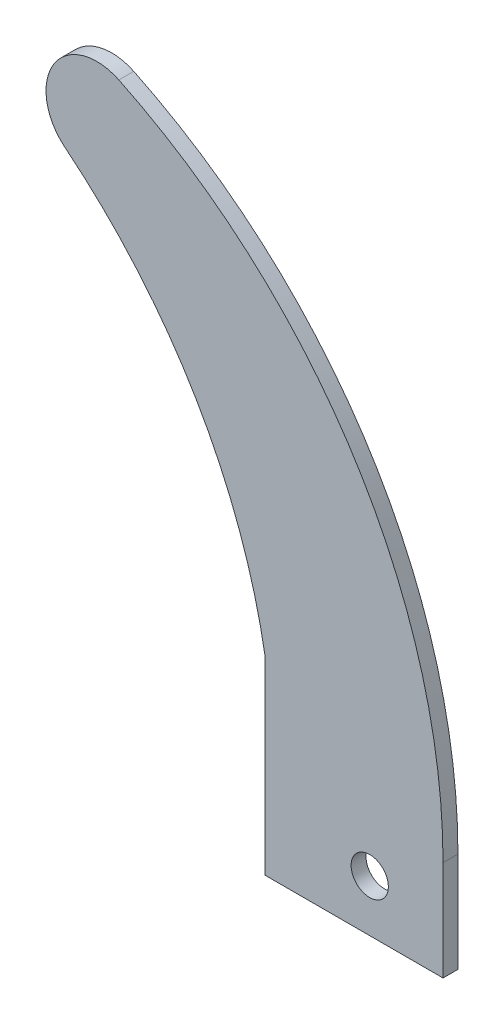
ISO-10303-21;
HEADER;
FILE_DESCRIPTION(('STEP AP214'),'2;1');
FILE_NAME('part.step','',(''),(''),'','','');
FILE_SCHEMA(('AUTOMOTIVE_DESIGN { 1 0 10303 214 1 1 1 1 }'));
ENDSEC;
DATA;
#1=APPLICATION_CONTEXT('core data for automotive mechanical design processes');
#2=APPLICATION_PROTOCOL_DEFINITION('international standard','automotive_design',2000,#1);
#3=PRODUCT_CONTEXT('',#1,'mechanical');
#4=PRODUCT('Part','Part','',(#3));
#5=PRODUCT_RELATED_PRODUCT_CATEGORY('part','',(#4));
#6=PRODUCT_DEFINITION_FORMATION('','',#4);
#7=PRODUCT_DEFINITION_CONTEXT('part definition',#1,'design');
#8=PRODUCT_DEFINITION('design','',#6,#7);
#9=PRODUCT_DEFINITION_SHAPE('','',#8);
#10=(LENGTH_UNIT() NAMED_UNIT(*) SI_UNIT(.MILLI.,.METRE.));
#11=(NAMED_UNIT(*) PLANE_ANGLE_UNIT() SI_UNIT($,.RADIAN.));
#12=(NAMED_UNIT(*) SI_UNIT($,.STERADIAN.) SOLID_ANGLE_UNIT());
#13=UNCERTAINTY_MEASURE_WITH_UNIT(LENGTH_MEASURE(1.E-05),#10,'distance_accuracy_value','');
#14=(GEOMETRIC_REPRESENTATION_CONTEXT(3) GLOBAL_UNCERTAINTY_ASSIGNED_CONTEXT((#13)) GLOBAL_UNIT_ASSIGNED_CONTEXT((#10,
#11,#12)) REPRESENTATION_CONTEXT('',''));
#15=CARTESIAN_POINT('',(0.,0.,0.));
#16=DIRECTION('',(0.,0.,1.));
#17=DIRECTION('',(1.,0.,0.));
#18=AXIS2_PLACEMENT_3D('',#15,#16,#17);
#19=CARTESIAN_POINT('',(-66.961118674711,6.46838453203618,2.));
#20=DIRECTION('',(0.,0.,1.));
#21=DIRECTION('',(1.,0.,0.));
#22=AXIS2_PLACEMENT_3D('',#19,#20,#21);
#23=PLANE('',#22);
#24=DIRECTION('',(0.,-1.,0.));
#25=VECTOR('',#24,1.);
#26=CARTESIAN_POINT('',(-14.0336686671728,18.503208773355,2.));
#27=LINE('',#26,#25);
#28=CARTESIAN_POINT('',(-14.0336686671728,18.503208773355,2.));
#29=VERTEX_POINT('',#28);
#30=CARTESIAN_POINT('',(-14.0336686671728,-6.92774167343622,2.));
#31=VERTEX_POINT('',#30);
#32=EDGE_CURVE('E129',#29,#31,#27,.T.);
#33=ORIENTED_EDGE('',*,*,#32,.T.);
#34=DIRECTION('',(1.,0.,0.));
#35=VECTOR('',#34,1.);
#36=CARTESIAN_POINT('',(-14.0336686671728,-6.92774167343622,2.));
#37=LINE('',#36,#35);
#38=CARTESIAN_POINT('',(9.83621253507358,-6.92774167343622,2.));
#39=VERTEX_POINT('',#38);
#40=EDGE_CURVE('E87',#31,#39,#37,.T.);
#41=ORIENTED_EDGE('',*,*,#40,.T.);
#42=DIRECTION('',(0.,1.,0.));
#43=VECTOR('',#42,1.);
#44=CARTESIAN_POINT('',(9.83621253507358,-6.92774167343622,2.));
#45=LINE('',#44,#43);
#46=CARTESIAN_POINT('',(9.83621253507358,6.46838453203618,2.));
#47=VERTEX_POINT('',#46);
#48=EDGE_CURVE('E100',#39,#47,#45,.T.);
#49=ORIENTED_EDGE('',*,*,#48,.T.);
#50=CARTESIAN_POINT('',(-66.961118674711,6.46838453203618,2.));
#51=DIRECTION('',(0.,0.,1.));
#52=DIRECTION('',(1.,0.,0.));
#53=AXIS2_PLACEMENT_3D('',#50,#51,#52);
#54=CIRCLE('',#53,76.7973312097845);
#55=CARTESIAN_POINT('',(-33.6561799216915,75.6681759739399,2.));
#56=VERTEX_POINT('',#55);
#57=EDGE_CURVE('E94',#47,#56,#54,.T.);
#58=ORIENTED_EDGE('',*,*,#57,.T.);
#59=CARTESIAN_POINT('',(-36.6124184298216,69.5258110312479,2.));
#60=DIRECTION('',(0.,0.,1.));
#61=DIRECTION('',(1.,0.,0.));
#62=AXIS2_PLACEMENT_3D('',#59,#60,#61);
#63=CIRCLE('',#62,6.81674359252003);
#64=CARTESIAN_POINT('',(-40.898194287924,64.2248565416989,2.));
#65=VERTEX_POINT('',#64);
#66=EDGE_CURVE('E98',#56,#65,#63,.T.);
#67=ORIENTED_EDGE('',*,*,#66,.T.);
#68=CARTESIAN_POINT('',(-88.261434941398,5.64260877739589,2.));
#69=DIRECTION('',(0.,0.,-1.));
#70=DIRECTION('',(-1.,0.,0.));
#71=AXIS2_PLACEMENT_3D('',#68,#69,#70);
#72=CIRCLE('',#71,75.333633380563);
#73=EDGE_CURVE('E50',#65,#29,#72,.T.);
#74=ORIENTED_EDGE('',*,*,#73,.T.);
#75=EDGE_LOOP('',(#33,#41,#49,#58,#67,#74));
#76=FACE_BOUND('',#75,.T.);
#77=CARTESIAN_POINT('',(0.,0.,2.));
#78=DIRECTION('',(0.,0.,1.));
#79=DIRECTION('',(1.,0.,0.));
#80=AXIS2_PLACEMENT_3D('',#77,#78,#79);
#81=CIRCLE('',#80,2.5);
#82=CARTESIAN_POINT('',(2.5,0.,2.));
#83=VERTEX_POINT('',#82);
#84=EDGE_CURVE('E122',#83,#83,#81,.T.);
#85=ORIENTED_EDGE('',*,*,#84,.F.);
#86=EDGE_LOOP('',(#85));
#87=FACE_BOUND('',#86,.T.);
#88=ADVANCED_FACE('F33',(#76,#87),#23,.T.);
#89=CARTESIAN_POINT('',(-66.961118674711,6.46838453203618,0.));
#90=DIRECTION('',(0.,0.,1.));
#91=DIRECTION('',(1.,0.,0.));
#92=AXIS2_PLACEMENT_3D('',#89,#90,#91);
#93=PLANE('',#92);
#94=DIRECTION('',(0.,-1.,0.));
#95=VECTOR('',#94,1.);
#96=CARTESIAN_POINT('',(-14.0336686671728,18.503208773355,0.));
#97=LINE('',#96,#95);
#98=CARTESIAN_POINT('',(-14.0336686671728,18.503208773355,0.));
#99=VERTEX_POINT('',#98);
#100=CARTESIAN_POINT('',(-14.0336686671728,-6.92774167343622,0.));
#101=VERTEX_POINT('',#100);
#102=EDGE_CURVE('E118',#99,#101,#97,.T.);
#103=ORIENTED_EDGE('',*,*,#102,.F.);
#104=CARTESIAN_POINT('',(-88.261434941398,5.64260877739589,0.));
#105=DIRECTION('',(0.,0.,-1.));
#106=DIRECTION('',(-1.,0.,0.));
#107=AXIS2_PLACEMENT_3D('',#104,#105,#106);
#108=CIRCLE('',#107,75.333633380563);
#109=CARTESIAN_POINT('',(-40.898194287924,64.2248565416989,0.));
#110=VERTEX_POINT('',#109);
#111=EDGE_CURVE('E79',#110,#99,#108,.T.);
#112=ORIENTED_EDGE('',*,*,#111,.F.);
#113=CARTESIAN_POINT('',(-36.6124184298216,69.5258110312479,0.));
#114=DIRECTION('',(0.,0.,1.));
#115=DIRECTION('',(1.,0.,0.));
#116=AXIS2_PLACEMENT_3D('',#113,#114,#115);
#117=CIRCLE('',#116,6.81674359252003);
#118=CARTESIAN_POINT('',(-33.6561799216915,75.6681759739399,0.));
#119=VERTEX_POINT('',#118);
#120=EDGE_CURVE('E73',#119,#110,#117,.T.);
#121=ORIENTED_EDGE('',*,*,#120,.F.);
#122=CARTESIAN_POINT('',(-66.961118674711,6.46838453203618,0.));
#123=DIRECTION('',(0.,0.,1.));
#124=DIRECTION('',(1.,0.,0.));
#125=AXIS2_PLACEMENT_3D('',#122,#123,#124);
#126=CIRCLE('',#125,76.7973312097845);
#127=CARTESIAN_POINT('',(9.83621253507358,6.46838453203618,0.));
#128=VERTEX_POINT('',#127);
#129=EDGE_CURVE('E108',#128,#119,#126,.T.);
#130=ORIENTED_EDGE('',*,*,#129,.F.);
#131=DIRECTION('',(0.,1.,0.));
#132=VECTOR('',#131,1.);
#133=CARTESIAN_POINT('',(9.83621253507358,-6.92774167343622,0.));
#134=LINE('',#133,#132);
#135=CARTESIAN_POINT('',(9.83621253507358,-6.92774167343622,0.));
#136=VERTEX_POINT('',#135);
#137=EDGE_CURVE('E124',#136,#128,#134,.T.);
#138=ORIENTED_EDGE('',*,*,#137,.F.);
#139=DIRECTION('',(1.,0.,0.));
#140=VECTOR('',#139,1.);
#141=CARTESIAN_POINT('',(-14.0336686671728,-6.92774167343622,0.));
#142=LINE('',#141,#140);
#143=EDGE_CURVE('E121',#101,#136,#142,.T.);
#144=ORIENTED_EDGE('',*,*,#143,.F.);
#145=EDGE_LOOP('',(#103,#112,#121,#130,#138,#144));
#146=FACE_BOUND('',#145,.T.);
#147=CARTESIAN_POINT('',(0.,0.,0.));
#148=DIRECTION('',(0.,0.,1.));
#149=DIRECTION('',(1.,0.,0.));
#150=AXIS2_PLACEMENT_3D('',#147,#148,#149);
#151=CIRCLE('',#150,2.5);
#152=CARTESIAN_POINT('',(2.5,0.,0.));
#153=VERTEX_POINT('',#152);
#154=EDGE_CURVE('E222',#153,#153,#151,.T.);
#155=ORIENTED_EDGE('',*,*,#154,.T.);
#156=EDGE_LOOP('',(#155));
#157=FACE_BOUND('',#156,.T.);
#158=ADVANCED_FACE('F138',(#146,#157),#93,.F.);
#159=CARTESIAN_POINT('',(-14.0336686671728,18.503208773355,2.));
#160=DIRECTION('',(1.,0.,0.));
#161=DIRECTION('',(0.,0.,-1.));
#162=AXIS2_PLACEMENT_3D('',#159,#160,#161);
#163=PLANE('',#162);
#164=ORIENTED_EDGE('',*,*,#102,.T.);
#165=DIRECTION('',(0.,0.,-1.));
#166=VECTOR('',#165,1.);
#167=CARTESIAN_POINT('',(-14.0336686671728,-6.92774167343622,2.));
#168=LINE('',#167,#166);
#169=EDGE_CURVE('E11',#31,#101,#168,.T.);
#170=ORIENTED_EDGE('',*,*,#169,.F.);
#171=ORIENTED_EDGE('',*,*,#32,.F.);
#172=DIRECTION('',(0.,0.,-1.));
#173=VECTOR('',#172,1.);
#174=CARTESIAN_POINT('',(-14.0336686671728,18.503208773355,2.));
#175=LINE('',#174,#173);
#176=EDGE_CURVE('E114',#29,#99,#175,.T.);
#177=ORIENTED_EDGE('',*,*,#176,.T.);
#178=EDGE_LOOP('',(#164,#170,#171,#177));
#179=FACE_BOUND('',#178,.T.);
#180=ADVANCED_FACE('F35',(#179),#163,.F.);
#181=CARTESIAN_POINT('',(-14.0336686671728,-6.92774167343622,2.));
#182=DIRECTION('',(0.,1.,0.));
#183=DIRECTION('',(0.,0.,1.));
#184=AXIS2_PLACEMENT_3D('',#181,#182,#183);
#185=PLANE('',#184);
#186=ORIENTED_EDGE('',*,*,#143,.T.);
#187=DIRECTION('',(0.,0.,-1.));
#188=VECTOR('',#187,1.);
#189=CARTESIAN_POINT('',(9.83621253507358,-6.92774167343622,2.));
#190=LINE('',#189,#188);
#191=EDGE_CURVE('E42',#39,#136,#190,.T.);
#192=ORIENTED_EDGE('',*,*,#191,.F.);
#193=ORIENTED_EDGE('',*,*,#40,.F.);
#194=ORIENTED_EDGE('',*,*,#169,.T.);
#195=EDGE_LOOP('',(#186,#192,#193,#194));
#196=FACE_BOUND('',#195,.T.);
#197=ADVANCED_FACE('F163',(#196),#185,.F.);
#198=CARTESIAN_POINT('',(9.83621253507358,-6.92774167343622,2.));
#199=DIRECTION('',(-1.,0.,0.));
#200=DIRECTION('',(0.,0.,1.));
#201=AXIS2_PLACEMENT_3D('',#198,#199,#200);
#202=PLANE('',#201);
#203=ORIENTED_EDGE('',*,*,#137,.T.);
#204=DIRECTION('',(0.,0.,-1.));
#205=VECTOR('',#204,1.);
#206=CARTESIAN_POINT('',(9.83621253507358,6.46838453203618,2.));
#207=LINE('',#206,#205);
#208=EDGE_CURVE('E109',#47,#128,#207,.T.);
#209=ORIENTED_EDGE('',*,*,#208,.F.);
#210=ORIENTED_EDGE('',*,*,#48,.F.);
#211=ORIENTED_EDGE('',*,*,#191,.T.);
#212=EDGE_LOOP('',(#203,#209,#210,#211));
#213=FACE_BOUND('',#212,.T.);
#214=ADVANCED_FACE('F135',(#213),#202,.F.);
#215=CARTESIAN_POINT('',(-66.961118674711,6.46838453203618,2.));
#216=DIRECTION('',(0.,0.,-1.));
#217=DIRECTION('',(-1.,0.,0.));
#218=AXIS2_PLACEMENT_3D('',#215,#216,#217);
#219=CYLINDRICAL_SURFACE('',#218,76.7973312097845);
#220=ORIENTED_EDGE('',*,*,#129,.T.);
#221=DIRECTION('',(0.,0.,-1.));
#222=VECTOR('',#221,1.);
#223=CARTESIAN_POINT('',(-33.6561799216915,75.6681759739399,2.));
#224=LINE('',#223,#222);
#225=EDGE_CURVE('E105',#56,#119,#224,.T.);
#226=ORIENTED_EDGE('',*,*,#225,.F.);
#227=ORIENTED_EDGE('',*,*,#57,.F.);
#228=ORIENTED_EDGE('',*,*,#208,.T.);
#229=EDGE_LOOP('',(#220,#226,#227,#228));
#230=FACE_BOUND('',#229,.T.);
#231=ADVANCED_FACE('F106',(#230),#219,.T.);
#232=CARTESIAN_POINT('',(-36.6124184298216,69.5258110312479,2.));
#233=DIRECTION('',(0.,0.,-1.));
#234=DIRECTION('',(-1.,0.,0.));
#235=AXIS2_PLACEMENT_3D('',#232,#233,#234);
#236=CYLINDRICAL_SURFACE('',#235,6.81674359252003);
#237=ORIENTED_EDGE('',*,*,#120,.T.);
#238=DIRECTION('',(0.,0.,-1.));
#239=VECTOR('',#238,1.);
#240=CARTESIAN_POINT('',(-40.898194287924,64.2248565416989,2.));
#241=LINE('',#240,#239);
#242=EDGE_CURVE('E110',#65,#110,#241,.T.);
#243=ORIENTED_EDGE('',*,*,#242,.F.);
#244=ORIENTED_EDGE('',*,*,#66,.F.);
#245=ORIENTED_EDGE('',*,*,#225,.T.);
#246=EDGE_LOOP('',(#237,#243,#244,#245));
#247=FACE_BOUND('',#246,.T.);
#248=ADVANCED_FACE('F112',(#247),#236,.T.);
#249=CARTESIAN_POINT('',(-88.261434941398,5.64260877739589,2.));
#250=DIRECTION('',(0.,0.,-1.));
#251=DIRECTION('',(-1.,0.,0.));
#252=AXIS2_PLACEMENT_3D('',#249,#250,#251);
#253=CYLINDRICAL_SURFACE('',#252,75.333633380563);
#254=ORIENTED_EDGE('',*,*,#111,.T.);
#255=ORIENTED_EDGE('',*,*,#176,.F.);
#256=ORIENTED_EDGE('',*,*,#73,.F.);
#257=ORIENTED_EDGE('',*,*,#242,.T.);
#258=EDGE_LOOP('',(#254,#255,#256,#257));
#259=FACE_BOUND('',#258,.T.);
#260=ADVANCED_FACE('F143',(#259),#253,.F.);
#261=CARTESIAN_POINT('',(0.,0.,2.));
#262=DIRECTION('',(0.,0.,-1.));
#263=DIRECTION('',(-1.,0.,0.));
#264=AXIS2_PLACEMENT_3D('',#261,#262,#263);
#265=CYLINDRICAL_SURFACE('',#264,2.5);
#266=ORIENTED_EDGE('',*,*,#84,.T.);
#267=EDGE_LOOP('',(#266));
#268=FACE_BOUND('',#267,.T.);
#269=ORIENTED_EDGE('',*,*,#154,.F.);
#270=EDGE_LOOP('',(#269));
#271=FACE_BOUND('',#270,.T.);
#272=ADVANCED_FACE('F145',(#268,#271),#265,.F.);
#273=CLOSED_SHELL('',(#88,#158,#180,#197,#214,#231,#248,#260,#272));
#274=MANIFOLD_SOLID_BREP('B2',#273);
#275=ADVANCED_BREP_SHAPE_REPRESENTATION('',(#18,#274),#14);
#276=SHAPE_DEFINITION_REPRESENTATION(#9,#275);
ENDSEC;
END-ISO-10303-21;
